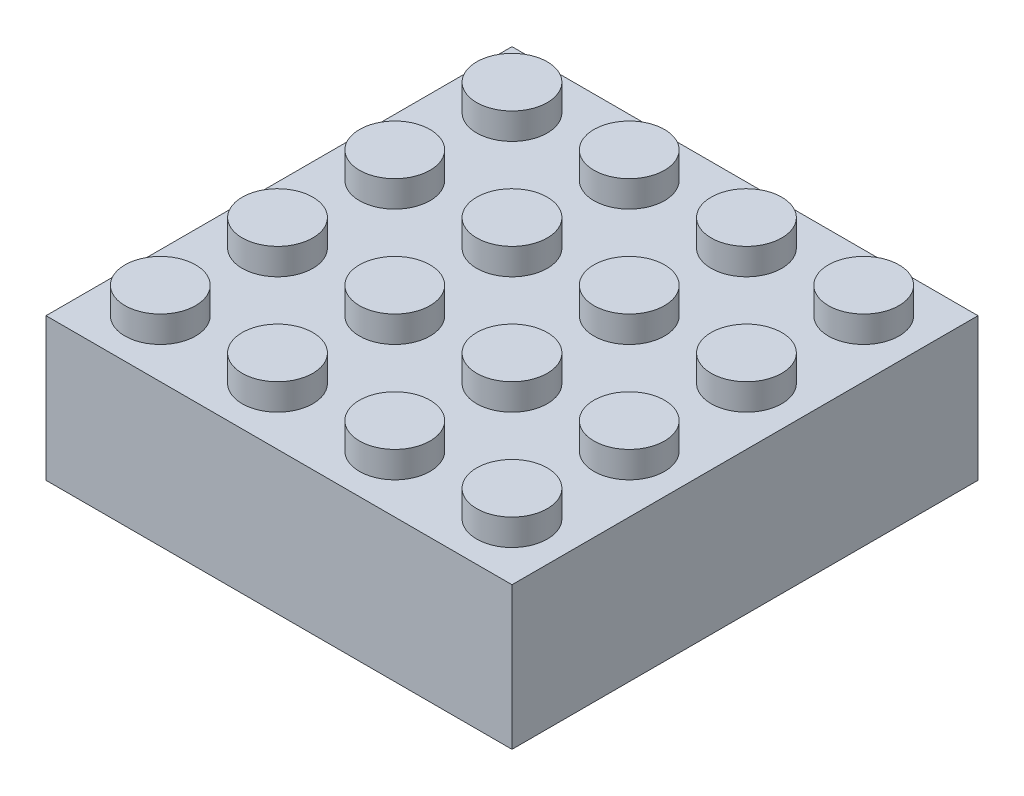
ISO-10303-21;
HEADER;
FILE_DESCRIPTION(('STEP AP214'),'2;1');
FILE_NAME('part.step','',(''),(''),'','','');
FILE_SCHEMA(('AUTOMOTIVE_DESIGN { 1 0 10303 214 1 1 1 1 }'));
ENDSEC;
DATA;
#1=APPLICATION_CONTEXT('core data for automotive mechanical design processes');
#2=APPLICATION_PROTOCOL_DEFINITION('international standard','automotive_design',2000,#1);
#3=PRODUCT_CONTEXT('',#1,'mechanical');
#4=PRODUCT('Part','Part','',(#3));
#5=PRODUCT_RELATED_PRODUCT_CATEGORY('part','',(#4));
#6=PRODUCT_DEFINITION_FORMATION('','',#4);
#7=PRODUCT_DEFINITION_CONTEXT('part definition',#1,'design');
#8=PRODUCT_DEFINITION('design','',#6,#7);
#9=PRODUCT_DEFINITION_SHAPE('','',#8);
#10=(LENGTH_UNIT() NAMED_UNIT(*) SI_UNIT(.MILLI.,.METRE.));
#11=(NAMED_UNIT(*) PLANE_ANGLE_UNIT() SI_UNIT($,.RADIAN.));
#12=(NAMED_UNIT(*) SI_UNIT($,.STERADIAN.) SOLID_ANGLE_UNIT());
#13=UNCERTAINTY_MEASURE_WITH_UNIT(LENGTH_MEASURE(1.E-05),#10,'distance_accuracy_value','');
#14=(GEOMETRIC_REPRESENTATION_CONTEXT(3) GLOBAL_UNCERTAINTY_ASSIGNED_CONTEXT((#13)) GLOBAL_UNIT_ASSIGNED_CONTEXT((#10,
#11,#12)) REPRESENTATION_CONTEXT('',''));
#15=CARTESIAN_POINT('',(0.,0.,0.));
#16=DIRECTION('',(0.,0.,1.));
#17=DIRECTION('',(1.,0.,0.));
#18=AXIS2_PLACEMENT_3D('',#15,#16,#17);
#19=CARTESIAN_POINT('',(3.90000000000025,1.8,-3.9));
#20=DIRECTION('',(0.,-1.,0.));
#21=DIRECTION('',(0.,0.,-1.));
#22=AXIS2_PLACEMENT_3D('',#19,#20,#21);
#23=CYLINDRICAL_SURFACE('',#22,2.41);
#24=CARTESIAN_POINT('',(3.90000000000025,1.8,-3.9));
#25=DIRECTION('',(0.,1.,0.));
#26=DIRECTION('',(0.,0.,1.));
#27=AXIS2_PLACEMENT_3D('',#24,#25,#26);
#28=CIRCLE('',#27,2.41);
#29=CARTESIAN_POINT('',(3.90000000000025,1.8,-1.49));
#30=VERTEX_POINT('',#29);
#31=EDGE_CURVE('E11',#30,#30,#28,.T.);
#32=ORIENTED_EDGE('',*,*,#31,.F.);
#33=EDGE_LOOP('',(#32));
#34=FACE_BOUND('',#33,.T.);
#35=CARTESIAN_POINT('',(3.90000000000025,0.,-3.9));
#36=DIRECTION('',(0.,1.,0.));
#37=DIRECTION('',(0.,0.,1.));
#38=AXIS2_PLACEMENT_3D('',#35,#36,#37);
#39=CIRCLE('',#38,2.41);
#40=CARTESIAN_POINT('',(3.90000000000025,0.,-1.49));
#41=VERTEX_POINT('',#40);
#42=EDGE_CURVE('E43',#41,#41,#39,.T.);
#43=ORIENTED_EDGE('',*,*,#42,.T.);
#44=EDGE_LOOP('',(#43));
#45=FACE_BOUND('',#44,.T.);
#46=ADVANCED_FACE('F40',(#34,#45),#23,.T.);
#47=CARTESIAN_POINT('',(3.90000000000025,1.8,-3.9));
#48=DIRECTION('',(0.,1.,0.));
#49=DIRECTION('',(0.,0.,1.));
#50=AXIS2_PLACEMENT_3D('',#47,#48,#49);
#51=PLANE('',#50);
#52=ORIENTED_EDGE('',*,*,#31,.T.);
#53=EDGE_LOOP('',(#52));
#54=FACE_BOUND('',#53,.T.);
#55=ADVANCED_FACE('F55',(#54),#51,.T.);
#56=CARTESIAN_POINT('',(3.90000000000025,0.,-3.9));
#57=DIRECTION('',(0.,1.,0.));
#58=DIRECTION('',(0.,0.,1.));
#59=AXIS2_PLACEMENT_3D('',#56,#57,#58);
#60=PLANE('',#59);
#61=ORIENTED_EDGE('',*,*,#42,.F.);
#62=EDGE_LOOP('',(#61));
#63=FACE_BOUND('',#62,.T.);
#64=ADVANCED_FACE('F53',(#63),#60,.F.);
#65=CLOSED_SHELL('',(#46,#55,#64));
#66=MANIFOLD_SOLID_BREP('B2',#65);
#67=CARTESIAN_POINT('',(3.90000000000017,1.8,-11.9));
#68=DIRECTION('',(0.,-1.,0.));
#69=DIRECTION('',(0.,0.,-1.));
#70=AXIS2_PLACEMENT_3D('',#67,#68,#69);
#71=CYLINDRICAL_SURFACE('',#70,2.41);
#72=CARTESIAN_POINT('',(3.90000000000017,1.8,-11.9));
#73=DIRECTION('',(0.,1.,0.));
#74=DIRECTION('',(0.,0.,1.));
#75=AXIS2_PLACEMENT_3D('',#72,#73,#74);
#76=CIRCLE('',#75,2.41);
#77=CARTESIAN_POINT('',(3.90000000000017,1.8,-9.49));
#78=VERTEX_POINT('',#77);
#79=EDGE_CURVE('E39',#78,#78,#76,.T.);
#80=ORIENTED_EDGE('',*,*,#79,.F.);
#81=EDGE_LOOP('',(#80));
#82=FACE_BOUND('',#81,.T.);
#83=CARTESIAN_POINT('',(3.90000000000017,0.,-11.9));
#84=DIRECTION('',(0.,1.,0.));
#85=DIRECTION('',(0.,0.,1.));
#86=AXIS2_PLACEMENT_3D('',#83,#84,#85);
#87=CIRCLE('',#86,2.41);
#88=CARTESIAN_POINT('',(3.90000000000017,0.,-9.49));
#89=VERTEX_POINT('',#88);
#90=EDGE_CURVE('E92',#89,#89,#87,.T.);
#91=ORIENTED_EDGE('',*,*,#90,.T.);
#92=EDGE_LOOP('',(#91));
#93=FACE_BOUND('',#92,.T.);
#94=ADVANCED_FACE('F89',(#82,#93),#71,.T.);
#95=CARTESIAN_POINT('',(3.90000000000017,1.8,-11.9));
#96=DIRECTION('',(0.,1.,0.));
#97=DIRECTION('',(0.,0.,1.));
#98=AXIS2_PLACEMENT_3D('',#95,#96,#97);
#99=PLANE('',#98);
#100=ORIENTED_EDGE('',*,*,#79,.T.);
#101=EDGE_LOOP('',(#100));
#102=FACE_BOUND('',#101,.T.);
#103=ADVANCED_FACE('F104',(#102),#99,.T.);
#104=CARTESIAN_POINT('',(3.90000000000017,0.,-11.9));
#105=DIRECTION('',(0.,1.,0.));
#106=DIRECTION('',(0.,0.,1.));
#107=AXIS2_PLACEMENT_3D('',#104,#105,#106);
#108=PLANE('',#107);
#109=ORIENTED_EDGE('',*,*,#90,.F.);
#110=EDGE_LOOP('',(#109));
#111=FACE_BOUND('',#110,.T.);
#112=ADVANCED_FACE('F102',(#111),#108,.F.);
#113=CLOSED_SHELL('',(#94,#103,#112));
#114=MANIFOLD_SOLID_BREP('B6',#113);
#115=CARTESIAN_POINT('',(3.90000000000008,1.8,-19.9));
#116=DIRECTION('',(0.,-1.,0.));
#117=DIRECTION('',(0.,0.,-1.));
#118=AXIS2_PLACEMENT_3D('',#115,#116,#117);
#119=CYLINDRICAL_SURFACE('',#118,2.41);
#120=CARTESIAN_POINT('',(3.90000000000008,1.8,-19.9));
#121=DIRECTION('',(0.,1.,0.));
#122=DIRECTION('',(0.,0.,1.));
#123=AXIS2_PLACEMENT_3D('',#120,#121,#122);
#124=CIRCLE('',#123,2.41);
#125=CARTESIAN_POINT('',(3.90000000000008,1.8,-17.49));
#126=VERTEX_POINT('',#125);
#127=EDGE_CURVE('E88',#126,#126,#124,.T.);
#128=ORIENTED_EDGE('',*,*,#127,.F.);
#129=EDGE_LOOP('',(#128));
#130=FACE_BOUND('',#129,.T.);
#131=CARTESIAN_POINT('',(3.90000000000008,0.,-19.9));
#132=DIRECTION('',(0.,1.,0.));
#133=DIRECTION('',(0.,0.,1.));
#134=AXIS2_PLACEMENT_3D('',#131,#132,#133);
#135=CIRCLE('',#134,2.41);
#136=CARTESIAN_POINT('',(3.90000000000008,0.,-17.49));
#137=VERTEX_POINT('',#136);
#138=EDGE_CURVE('E141',#137,#137,#135,.T.);
#139=ORIENTED_EDGE('',*,*,#138,.T.);
#140=EDGE_LOOP('',(#139));
#141=FACE_BOUND('',#140,.T.);
#142=ADVANCED_FACE('F138',(#130,#141),#119,.T.);
#143=CARTESIAN_POINT('',(3.90000000000008,1.8,-19.9));
#144=DIRECTION('',(0.,1.,0.));
#145=DIRECTION('',(0.,0.,1.));
#146=AXIS2_PLACEMENT_3D('',#143,#144,#145);
#147=PLANE('',#146);
#148=ORIENTED_EDGE('',*,*,#127,.T.);
#149=EDGE_LOOP('',(#148));
#150=FACE_BOUND('',#149,.T.);
#151=ADVANCED_FACE('F153',(#150),#147,.T.);
#152=CARTESIAN_POINT('',(3.90000000000008,0.,-19.9));
#153=DIRECTION('',(0.,1.,0.));
#154=DIRECTION('',(0.,0.,1.));
#155=AXIS2_PLACEMENT_3D('',#152,#153,#154);
#156=PLANE('',#155);
#157=ORIENTED_EDGE('',*,*,#138,.F.);
#158=EDGE_LOOP('',(#157));
#159=FACE_BOUND('',#158,.T.);
#160=ADVANCED_FACE('F151',(#159),#156,.F.);
#161=CLOSED_SHELL('',(#142,#151,#160));
#162=MANIFOLD_SOLID_BREP('B34',#161);
#163=CARTESIAN_POINT('',(27.9000000000003,1.8,-3.9));
#164=DIRECTION('',(0.,-1.,0.));
#165=DIRECTION('',(0.,0.,-1.));
#166=AXIS2_PLACEMENT_3D('',#163,#164,#165);
#167=CYLINDRICAL_SURFACE('',#166,2.41);
#168=CARTESIAN_POINT('',(27.9000000000003,1.8,-3.9));
#169=DIRECTION('',(0.,1.,0.));
#170=DIRECTION('',(0.,0.,1.));
#171=AXIS2_PLACEMENT_3D('',#168,#169,#170);
#172=CIRCLE('',#171,2.41);
#173=CARTESIAN_POINT('',(27.9000000000003,1.8,-1.49));
#174=VERTEX_POINT('',#173);
#175=EDGE_CURVE('E137',#174,#174,#172,.T.);
#176=ORIENTED_EDGE('',*,*,#175,.F.);
#177=EDGE_LOOP('',(#176));
#178=FACE_BOUND('',#177,.T.);
#179=CARTESIAN_POINT('',(27.9000000000003,0.,-3.9));
#180=DIRECTION('',(0.,1.,0.));
#181=DIRECTION('',(0.,0.,1.));
#182=AXIS2_PLACEMENT_3D('',#179,#180,#181);
#183=CIRCLE('',#182,2.41);
#184=CARTESIAN_POINT('',(27.9000000000003,0.,-1.49));
#185=VERTEX_POINT('',#184);
#186=EDGE_CURVE('E190',#185,#185,#183,.T.);
#187=ORIENTED_EDGE('',*,*,#186,.T.);
#188=EDGE_LOOP('',(#187));
#189=FACE_BOUND('',#188,.T.);
#190=ADVANCED_FACE('F187',(#178,#189),#167,.T.);
#191=CARTESIAN_POINT('',(27.9000000000003,1.8,-3.9));
#192=DIRECTION('',(0.,1.,0.));
#193=DIRECTION('',(0.,0.,1.));
#194=AXIS2_PLACEMENT_3D('',#191,#192,#193);
#195=PLANE('',#194);
#196=ORIENTED_EDGE('',*,*,#175,.T.);
#197=EDGE_LOOP('',(#196));
#198=FACE_BOUND('',#197,.T.);
#199=ADVANCED_FACE('F202',(#198),#195,.T.);
#200=CARTESIAN_POINT('',(27.9000000000003,0.,-3.9));
#201=DIRECTION('',(0.,1.,0.));
#202=DIRECTION('',(0.,0.,1.));
#203=AXIS2_PLACEMENT_3D('',#200,#201,#202);
#204=PLANE('',#203);
#205=ORIENTED_EDGE('',*,*,#186,.F.);
#206=EDGE_LOOP('',(#205));
#207=FACE_BOUND('',#206,.T.);
#208=ADVANCED_FACE('F200',(#207),#204,.F.);
#209=CLOSED_SHELL('',(#190,#199,#208));
#210=MANIFOLD_SOLID_BREP('B83',#209);
#211=CARTESIAN_POINT('',(19.9000000000003,1.8,-3.9));
#212=DIRECTION('',(0.,-1.,0.));
#213=DIRECTION('',(0.,0.,-1.));
#214=AXIS2_PLACEMENT_3D('',#211,#212,#213);
#215=CYLINDRICAL_SURFACE('',#214,2.41);
#216=CARTESIAN_POINT('',(19.9000000000003,1.8,-3.9));
#217=DIRECTION('',(0.,1.,0.));
#218=DIRECTION('',(0.,0.,1.));
#219=AXIS2_PLACEMENT_3D('',#216,#217,#218);
#220=CIRCLE('',#219,2.41);
#221=CARTESIAN_POINT('',(19.9000000000003,1.8,-1.49));
#222=VERTEX_POINT('',#221);
#223=EDGE_CURVE('E186',#222,#222,#220,.T.);
#224=ORIENTED_EDGE('',*,*,#223,.F.);
#225=EDGE_LOOP('',(#224));
#226=FACE_BOUND('',#225,.T.);
#227=CARTESIAN_POINT('',(19.9000000000003,0.,-3.9));
#228=DIRECTION('',(0.,1.,0.));
#229=DIRECTION('',(0.,0.,1.));
#230=AXIS2_PLACEMENT_3D('',#227,#228,#229);
#231=CIRCLE('',#230,2.41);
#232=CARTESIAN_POINT('',(19.9000000000003,0.,-1.49));
#233=VERTEX_POINT('',#232);
#234=EDGE_CURVE('E239',#233,#233,#231,.T.);
#235=ORIENTED_EDGE('',*,*,#234,.T.);
#236=EDGE_LOOP('',(#235));
#237=FACE_BOUND('',#236,.T.);
#238=ADVANCED_FACE('F236',(#226,#237),#215,.T.);
#239=CARTESIAN_POINT('',(19.9000000000003,1.8,-3.9));
#240=DIRECTION('',(0.,1.,0.));
#241=DIRECTION('',(0.,0.,1.));
#242=AXIS2_PLACEMENT_3D('',#239,#240,#241);
#243=PLANE('',#242);
#244=ORIENTED_EDGE('',*,*,#223,.T.);
#245=EDGE_LOOP('',(#244));
#246=FACE_BOUND('',#245,.T.);
#247=ADVANCED_FACE('F251',(#246),#243,.T.);
#248=CARTESIAN_POINT('',(19.9000000000003,0.,-3.9));
#249=DIRECTION('',(0.,1.,0.));
#250=DIRECTION('',(0.,0.,1.));
#251=AXIS2_PLACEMENT_3D('',#248,#249,#250);
#252=PLANE('',#251);
#253=ORIENTED_EDGE('',*,*,#234,.F.);
#254=EDGE_LOOP('',(#253));
#255=FACE_BOUND('',#254,.T.);
#256=ADVANCED_FACE('F249',(#255),#252,.F.);
#257=CLOSED_SHELL('',(#238,#247,#256));
#258=MANIFOLD_SOLID_BREP('B132',#257);
#259=CARTESIAN_POINT('',(11.9000000000003,1.8,-3.9));
#260=DIRECTION('',(0.,-1.,0.));
#261=DIRECTION('',(0.,0.,-1.));
#262=AXIS2_PLACEMENT_3D('',#259,#260,#261);
#263=CYLINDRICAL_SURFACE('',#262,2.41);
#264=CARTESIAN_POINT('',(11.9000000000003,1.8,-3.9));
#265=DIRECTION('',(0.,1.,0.));
#266=DIRECTION('',(0.,0.,1.));
#267=AXIS2_PLACEMENT_3D('',#264,#265,#266);
#268=CIRCLE('',#267,2.41);
#269=CARTESIAN_POINT('',(11.9000000000003,1.8,-1.49));
#270=VERTEX_POINT('',#269);
#271=EDGE_CURVE('E235',#270,#270,#268,.T.);
#272=ORIENTED_EDGE('',*,*,#271,.F.);
#273=EDGE_LOOP('',(#272));
#274=FACE_BOUND('',#273,.T.);
#275=CARTESIAN_POINT('',(11.9000000000003,0.,-3.9));
#276=DIRECTION('',(0.,1.,0.));
#277=DIRECTION('',(0.,0.,1.));
#278=AXIS2_PLACEMENT_3D('',#275,#276,#277);
#279=CIRCLE('',#278,2.41);
#280=CARTESIAN_POINT('',(11.9000000000003,0.,-1.49));
#281=VERTEX_POINT('',#280);
#282=EDGE_CURVE('E288',#281,#281,#279,.T.);
#283=ORIENTED_EDGE('',*,*,#282,.T.);
#284=EDGE_LOOP('',(#283));
#285=FACE_BOUND('',#284,.T.);
#286=ADVANCED_FACE('F285',(#274,#285),#263,.T.);
#287=CARTESIAN_POINT('',(11.9000000000003,1.8,-3.9));
#288=DIRECTION('',(0.,1.,0.));
#289=DIRECTION('',(0.,0.,1.));
#290=AXIS2_PLACEMENT_3D('',#287,#288,#289);
#291=PLANE('',#290);
#292=ORIENTED_EDGE('',*,*,#271,.T.);
#293=EDGE_LOOP('',(#292));
#294=FACE_BOUND('',#293,.T.);
#295=ADVANCED_FACE('F300',(#294),#291,.T.);
#296=CARTESIAN_POINT('',(11.9000000000003,0.,-3.9));
#297=DIRECTION('',(0.,1.,0.));
#298=DIRECTION('',(0.,0.,1.));
#299=AXIS2_PLACEMENT_3D('',#296,#297,#298);
#300=PLANE('',#299);
#301=ORIENTED_EDGE('',*,*,#282,.F.);
#302=EDGE_LOOP('',(#301));
#303=FACE_BOUND('',#302,.T.);
#304=ADVANCED_FACE('F298',(#303),#300,.F.);
#305=CLOSED_SHELL('',(#286,#295,#304));
#306=MANIFOLD_SOLID_BREP('B181',#305);
#307=CARTESIAN_POINT('',(27.9000000000002,1.8,-11.9));
#308=DIRECTION('',(0.,-1.,0.));
#309=DIRECTION('',(0.,0.,-1.));
#310=AXIS2_PLACEMENT_3D('',#307,#308,#309);
#311=CYLINDRICAL_SURFACE('',#310,2.41);
#312=CARTESIAN_POINT('',(27.9000000000002,1.8,-11.9));
#313=DIRECTION('',(0.,1.,0.));
#314=DIRECTION('',(0.,0.,1.));
#315=AXIS2_PLACEMENT_3D('',#312,#313,#314);
#316=CIRCLE('',#315,2.41);
#317=CARTESIAN_POINT('',(27.9000000000002,1.8,-9.49));
#318=VERTEX_POINT('',#317);
#319=EDGE_CURVE('E284',#318,#318,#316,.T.);
#320=ORIENTED_EDGE('',*,*,#319,.F.);
#321=EDGE_LOOP('',(#320));
#322=FACE_BOUND('',#321,.T.);
#323=CARTESIAN_POINT('',(27.9000000000002,0.,-11.9));
#324=DIRECTION('',(0.,1.,0.));
#325=DIRECTION('',(0.,0.,1.));
#326=AXIS2_PLACEMENT_3D('',#323,#324,#325);
#327=CIRCLE('',#326,2.41);
#328=CARTESIAN_POINT('',(27.9000000000002,0.,-9.49));
#329=VERTEX_POINT('',#328);
#330=EDGE_CURVE('E337',#329,#329,#327,.T.);
#331=ORIENTED_EDGE('',*,*,#330,.T.);
#332=EDGE_LOOP('',(#331));
#333=FACE_BOUND('',#332,.T.);
#334=ADVANCED_FACE('F334',(#322,#333),#311,.T.);
#335=CARTESIAN_POINT('',(27.9000000000002,1.8,-11.9));
#336=DIRECTION('',(0.,1.,0.));
#337=DIRECTION('',(0.,0.,1.));
#338=AXIS2_PLACEMENT_3D('',#335,#336,#337);
#339=PLANE('',#338);
#340=ORIENTED_EDGE('',*,*,#319,.T.);
#341=EDGE_LOOP('',(#340));
#342=FACE_BOUND('',#341,.T.);
#343=ADVANCED_FACE('F349',(#342),#339,.T.);
#344=CARTESIAN_POINT('',(27.9000000000002,0.,-11.9));
#345=DIRECTION('',(0.,1.,0.));
#346=DIRECTION('',(0.,0.,1.));
#347=AXIS2_PLACEMENT_3D('',#344,#345,#346);
#348=PLANE('',#347);
#349=ORIENTED_EDGE('',*,*,#330,.F.);
#350=EDGE_LOOP('',(#349));
#351=FACE_BOUND('',#350,.T.);
#352=ADVANCED_FACE('F347',(#351),#348,.F.);
#353=CLOSED_SHELL('',(#334,#343,#352));
#354=MANIFOLD_SOLID_BREP('B230',#353);
#355=CARTESIAN_POINT('',(19.9000000000002,1.8,-11.9));
#356=DIRECTION('',(0.,-1.,0.));
#357=DIRECTION('',(0.,0.,-1.));
#358=AXIS2_PLACEMENT_3D('',#355,#356,#357);
#359=CYLINDRICAL_SURFACE('',#358,2.41);
#360=CARTESIAN_POINT('',(19.9000000000002,1.8,-11.9));
#361=DIRECTION('',(0.,1.,0.));
#362=DIRECTION('',(0.,0.,1.));
#363=AXIS2_PLACEMENT_3D('',#360,#361,#362);
#364=CIRCLE('',#363,2.41);
#365=CARTESIAN_POINT('',(19.9000000000002,1.8,-9.49));
#366=VERTEX_POINT('',#365);
#367=EDGE_CURVE('E333',#366,#366,#364,.T.);
#368=ORIENTED_EDGE('',*,*,#367,.F.);
#369=EDGE_LOOP('',(#368));
#370=FACE_BOUND('',#369,.T.);
#371=CARTESIAN_POINT('',(19.9000000000002,0.,-11.9));
#372=DIRECTION('',(0.,1.,0.));
#373=DIRECTION('',(0.,0.,1.));
#374=AXIS2_PLACEMENT_3D('',#371,#372,#373);
#375=CIRCLE('',#374,2.41);
#376=CARTESIAN_POINT('',(19.9000000000002,0.,-9.49));
#377=VERTEX_POINT('',#376);
#378=EDGE_CURVE('E386',#377,#377,#375,.T.);
#379=ORIENTED_EDGE('',*,*,#378,.T.);
#380=EDGE_LOOP('',(#379));
#381=FACE_BOUND('',#380,.T.);
#382=ADVANCED_FACE('F383',(#370,#381),#359,.T.);
#383=CARTESIAN_POINT('',(19.9000000000002,1.8,-11.9));
#384=DIRECTION('',(0.,1.,0.));
#385=DIRECTION('',(0.,0.,1.));
#386=AXIS2_PLACEMENT_3D('',#383,#384,#385);
#387=PLANE('',#386);
#388=ORIENTED_EDGE('',*,*,#367,.T.);
#389=EDGE_LOOP('',(#388));
#390=FACE_BOUND('',#389,.T.);
#391=ADVANCED_FACE('F398',(#390),#387,.T.);
#392=CARTESIAN_POINT('',(19.9000000000002,0.,-11.9));
#393=DIRECTION('',(0.,1.,0.));
#394=DIRECTION('',(0.,0.,1.));
#395=AXIS2_PLACEMENT_3D('',#392,#393,#394);
#396=PLANE('',#395);
#397=ORIENTED_EDGE('',*,*,#378,.F.);
#398=EDGE_LOOP('',(#397));
#399=FACE_BOUND('',#398,.T.);
#400=ADVANCED_FACE('F396',(#399),#396,.F.);
#401=CLOSED_SHELL('',(#382,#391,#400));
#402=MANIFOLD_SOLID_BREP('B279',#401);
#403=CARTESIAN_POINT('',(11.9000000000002,1.8,-11.9));
#404=DIRECTION('',(0.,-1.,0.));
#405=DIRECTION('',(0.,0.,-1.));
#406=AXIS2_PLACEMENT_3D('',#403,#404,#405);
#407=CYLINDRICAL_SURFACE('',#406,2.41);
#408=CARTESIAN_POINT('',(11.9000000000002,1.8,-11.9));
#409=DIRECTION('',(0.,1.,0.));
#410=DIRECTION('',(0.,0.,1.));
#411=AXIS2_PLACEMENT_3D('',#408,#409,#410);
#412=CIRCLE('',#411,2.41);
#413=CARTESIAN_POINT('',(11.9000000000002,1.8,-9.49));
#414=VERTEX_POINT('',#413);
#415=EDGE_CURVE('E382',#414,#414,#412,.T.);
#416=ORIENTED_EDGE('',*,*,#415,.F.);
#417=EDGE_LOOP('',(#416));
#418=FACE_BOUND('',#417,.T.);
#419=CARTESIAN_POINT('',(11.9000000000002,0.,-11.9));
#420=DIRECTION('',(0.,1.,0.));
#421=DIRECTION('',(0.,0.,1.));
#422=AXIS2_PLACEMENT_3D('',#419,#420,#421);
#423=CIRCLE('',#422,2.41);
#424=CARTESIAN_POINT('',(11.9000000000002,0.,-9.49));
#425=VERTEX_POINT('',#424);
#426=EDGE_CURVE('E435',#425,#425,#423,.T.);
#427=ORIENTED_EDGE('',*,*,#426,.T.);
#428=EDGE_LOOP('',(#427));
#429=FACE_BOUND('',#428,.T.);
#430=ADVANCED_FACE('F432',(#418,#429),#407,.T.);
#431=CARTESIAN_POINT('',(11.9000000000002,1.8,-11.9));
#432=DIRECTION('',(0.,1.,0.));
#433=DIRECTION('',(0.,0.,1.));
#434=AXIS2_PLACEMENT_3D('',#431,#432,#433);
#435=PLANE('',#434);
#436=ORIENTED_EDGE('',*,*,#415,.T.);
#437=EDGE_LOOP('',(#436));
#438=FACE_BOUND('',#437,.T.);
#439=ADVANCED_FACE('F447',(#438),#435,.T.);
#440=CARTESIAN_POINT('',(11.9000000000002,0.,-11.9));
#441=DIRECTION('',(0.,1.,0.));
#442=DIRECTION('',(0.,0.,1.));
#443=AXIS2_PLACEMENT_3D('',#440,#441,#442);
#444=PLANE('',#443);
#445=ORIENTED_EDGE('',*,*,#426,.F.);
#446=EDGE_LOOP('',(#445));
#447=FACE_BOUND('',#446,.T.);
#448=ADVANCED_FACE('F445',(#447),#444,.F.);
#449=CLOSED_SHELL('',(#430,#439,#448));
#450=MANIFOLD_SOLID_BREP('B328',#449);
#451=CARTESIAN_POINT('',(27.9000000000001,1.8,-19.9));
#452=DIRECTION('',(0.,-1.,0.));
#453=DIRECTION('',(0.,0.,-1.));
#454=AXIS2_PLACEMENT_3D('',#451,#452,#453);
#455=CYLINDRICAL_SURFACE('',#454,2.41);
#456=CARTESIAN_POINT('',(27.9000000000001,1.8,-19.9));
#457=DIRECTION('',(0.,1.,0.));
#458=DIRECTION('',(0.,0.,1.));
#459=AXIS2_PLACEMENT_3D('',#456,#457,#458);
#460=CIRCLE('',#459,2.41);
#461=CARTESIAN_POINT('',(27.9000000000001,1.8,-17.49));
#462=VERTEX_POINT('',#461);
#463=EDGE_CURVE('E431',#462,#462,#460,.T.);
#464=ORIENTED_EDGE('',*,*,#463,.F.);
#465=EDGE_LOOP('',(#464));
#466=FACE_BOUND('',#465,.T.);
#467=CARTESIAN_POINT('',(27.9000000000001,0.,-19.9));
#468=DIRECTION('',(0.,1.,0.));
#469=DIRECTION('',(0.,0.,1.));
#470=AXIS2_PLACEMENT_3D('',#467,#468,#469);
#471=CIRCLE('',#470,2.41);
#472=CARTESIAN_POINT('',(27.9000000000001,0.,-17.49));
#473=VERTEX_POINT('',#472);
#474=EDGE_CURVE('E484',#473,#473,#471,.T.);
#475=ORIENTED_EDGE('',*,*,#474,.T.);
#476=EDGE_LOOP('',(#475));
#477=FACE_BOUND('',#476,.T.);
#478=ADVANCED_FACE('F481',(#466,#477),#455,.T.);
#479=CARTESIAN_POINT('',(27.9000000000001,1.8,-19.9));
#480=DIRECTION('',(0.,1.,0.));
#481=DIRECTION('',(0.,0.,1.));
#482=AXIS2_PLACEMENT_3D('',#479,#480,#481);
#483=PLANE('',#482);
#484=ORIENTED_EDGE('',*,*,#463,.T.);
#485=EDGE_LOOP('',(#484));
#486=FACE_BOUND('',#485,.T.);
#487=ADVANCED_FACE('F496',(#486),#483,.T.);
#488=CARTESIAN_POINT('',(27.9000000000001,0.,-19.9));
#489=DIRECTION('',(0.,1.,0.));
#490=DIRECTION('',(0.,0.,1.));
#491=AXIS2_PLACEMENT_3D('',#488,#489,#490);
#492=PLANE('',#491);
#493=ORIENTED_EDGE('',*,*,#474,.F.);
#494=EDGE_LOOP('',(#493));
#495=FACE_BOUND('',#494,.T.);
#496=ADVANCED_FACE('F494',(#495),#492,.F.);
#497=CLOSED_SHELL('',(#478,#487,#496));
#498=MANIFOLD_SOLID_BREP('B377',#497);
#499=CARTESIAN_POINT('',(19.9000000000001,1.8,-19.9));
#500=DIRECTION('',(0.,-1.,0.));
#501=DIRECTION('',(0.,0.,-1.));
#502=AXIS2_PLACEMENT_3D('',#499,#500,#501);
#503=CYLINDRICAL_SURFACE('',#502,2.41);
#504=CARTESIAN_POINT('',(19.9000000000001,1.8,-19.9));
#505=DIRECTION('',(0.,1.,0.));
#506=DIRECTION('',(0.,0.,1.));
#507=AXIS2_PLACEMENT_3D('',#504,#505,#506);
#508=CIRCLE('',#507,2.41);
#509=CARTESIAN_POINT('',(19.9000000000001,1.8,-17.49));
#510=VERTEX_POINT('',#509);
#511=EDGE_CURVE('E480',#510,#510,#508,.T.);
#512=ORIENTED_EDGE('',*,*,#511,.F.);
#513=EDGE_LOOP('',(#512));
#514=FACE_BOUND('',#513,.T.);
#515=CARTESIAN_POINT('',(19.9000000000001,0.,-19.9));
#516=DIRECTION('',(0.,1.,0.));
#517=DIRECTION('',(0.,0.,1.));
#518=AXIS2_PLACEMENT_3D('',#515,#516,#517);
#519=CIRCLE('',#518,2.41);
#520=CARTESIAN_POINT('',(19.9000000000001,0.,-17.49));
#521=VERTEX_POINT('',#520);
#522=EDGE_CURVE('E533',#521,#521,#519,.T.);
#523=ORIENTED_EDGE('',*,*,#522,.T.);
#524=EDGE_LOOP('',(#523));
#525=FACE_BOUND('',#524,.T.);
#526=ADVANCED_FACE('F530',(#514,#525),#503,.T.);
#527=CARTESIAN_POINT('',(19.9000000000001,1.8,-19.9));
#528=DIRECTION('',(0.,1.,0.));
#529=DIRECTION('',(0.,0.,1.));
#530=AXIS2_PLACEMENT_3D('',#527,#528,#529);
#531=PLANE('',#530);
#532=ORIENTED_EDGE('',*,*,#511,.T.);
#533=EDGE_LOOP('',(#532));
#534=FACE_BOUND('',#533,.T.);
#535=ADVANCED_FACE('F545',(#534),#531,.T.);
#536=CARTESIAN_POINT('',(19.9000000000001,0.,-19.9));
#537=DIRECTION('',(0.,1.,0.));
#538=DIRECTION('',(0.,0.,1.));
#539=AXIS2_PLACEMENT_3D('',#536,#537,#538);
#540=PLANE('',#539);
#541=ORIENTED_EDGE('',*,*,#522,.F.);
#542=EDGE_LOOP('',(#541));
#543=FACE_BOUND('',#542,.T.);
#544=ADVANCED_FACE('F543',(#543),#540,.F.);
#545=CLOSED_SHELL('',(#526,#535,#544));
#546=MANIFOLD_SOLID_BREP('B426',#545);
#547=CARTESIAN_POINT('',(11.9000000000001,1.8,-19.9));
#548=DIRECTION('',(0.,-1.,0.));
#549=DIRECTION('',(0.,0.,-1.));
#550=AXIS2_PLACEMENT_3D('',#547,#548,#549);
#551=CYLINDRICAL_SURFACE('',#550,2.41);
#552=CARTESIAN_POINT('',(11.9000000000001,1.8,-19.9));
#553=DIRECTION('',(0.,1.,0.));
#554=DIRECTION('',(0.,0.,1.));
#555=AXIS2_PLACEMENT_3D('',#552,#553,#554);
#556=CIRCLE('',#555,2.41);
#557=CARTESIAN_POINT('',(11.9000000000001,1.8,-17.49));
#558=VERTEX_POINT('',#557);
#559=EDGE_CURVE('E529',#558,#558,#556,.T.);
#560=ORIENTED_EDGE('',*,*,#559,.F.);
#561=EDGE_LOOP('',(#560));
#562=FACE_BOUND('',#561,.T.);
#563=CARTESIAN_POINT('',(11.9000000000001,0.,-19.9));
#564=DIRECTION('',(0.,1.,0.));
#565=DIRECTION('',(0.,0.,1.));
#566=AXIS2_PLACEMENT_3D('',#563,#564,#565);
#567=CIRCLE('',#566,2.41);
#568=CARTESIAN_POINT('',(11.9000000000001,0.,-17.49));
#569=VERTEX_POINT('',#568);
#570=EDGE_CURVE('E582',#569,#569,#567,.T.);
#571=ORIENTED_EDGE('',*,*,#570,.T.);
#572=EDGE_LOOP('',(#571));
#573=FACE_BOUND('',#572,.T.);
#574=ADVANCED_FACE('F579',(#562,#573),#551,.T.);
#575=CARTESIAN_POINT('',(11.9000000000001,1.8,-19.9));
#576=DIRECTION('',(0.,1.,0.));
#577=DIRECTION('',(0.,0.,1.));
#578=AXIS2_PLACEMENT_3D('',#575,#576,#577);
#579=PLANE('',#578);
#580=ORIENTED_EDGE('',*,*,#559,.T.);
#581=EDGE_LOOP('',(#580));
#582=FACE_BOUND('',#581,.T.);
#583=ADVANCED_FACE('F594',(#582),#579,.T.);
#584=CARTESIAN_POINT('',(11.9000000000001,0.,-19.9));
#585=DIRECTION('',(0.,1.,0.));
#586=DIRECTION('',(0.,0.,1.));
#587=AXIS2_PLACEMENT_3D('',#584,#585,#586);
#588=PLANE('',#587);
#589=ORIENTED_EDGE('',*,*,#570,.F.);
#590=EDGE_LOOP('',(#589));
#591=FACE_BOUND('',#590,.T.);
#592=ADVANCED_FACE('F592',(#591),#588,.F.);
#593=CLOSED_SHELL('',(#574,#583,#592));
#594=MANIFOLD_SOLID_BREP('B475',#593);
#595=CARTESIAN_POINT('',(27.9,1.8,-27.9));
#596=DIRECTION('',(0.,-1.,0.));
#597=DIRECTION('',(0.,0.,-1.));
#598=AXIS2_PLACEMENT_3D('',#595,#596,#597);
#599=CYLINDRICAL_SURFACE('',#598,2.41);
#600=CARTESIAN_POINT('',(27.9,1.8,-27.9));
#601=DIRECTION('',(0.,1.,0.));
#602=DIRECTION('',(0.,0.,1.));
#603=AXIS2_PLACEMENT_3D('',#600,#601,#602);
#604=CIRCLE('',#603,2.41);
#605=CARTESIAN_POINT('',(27.9,1.8,-25.49));
#606=VERTEX_POINT('',#605);
#607=EDGE_CURVE('E578',#606,#606,#604,.T.);
#608=ORIENTED_EDGE('',*,*,#607,.F.);
#609=EDGE_LOOP('',(#608));
#610=FACE_BOUND('',#609,.T.);
#611=CARTESIAN_POINT('',(27.9,0.,-27.9));
#612=DIRECTION('',(0.,1.,0.));
#613=DIRECTION('',(0.,0.,1.));
#614=AXIS2_PLACEMENT_3D('',#611,#612,#613);
#615=CIRCLE('',#614,2.41);
#616=CARTESIAN_POINT('',(27.9,0.,-25.49));
#617=VERTEX_POINT('',#616);
#618=EDGE_CURVE('E631',#617,#617,#615,.T.);
#619=ORIENTED_EDGE('',*,*,#618,.T.);
#620=EDGE_LOOP('',(#619));
#621=FACE_BOUND('',#620,.T.);
#622=ADVANCED_FACE('F628',(#610,#621),#599,.T.);
#623=CARTESIAN_POINT('',(27.9,1.8,-27.9));
#624=DIRECTION('',(0.,1.,0.));
#625=DIRECTION('',(0.,0.,1.));
#626=AXIS2_PLACEMENT_3D('',#623,#624,#625);
#627=PLANE('',#626);
#628=ORIENTED_EDGE('',*,*,#607,.T.);
#629=EDGE_LOOP('',(#628));
#630=FACE_BOUND('',#629,.T.);
#631=ADVANCED_FACE('F643',(#630),#627,.T.);
#632=CARTESIAN_POINT('',(27.9,0.,-27.9));
#633=DIRECTION('',(0.,1.,0.));
#634=DIRECTION('',(0.,0.,1.));
#635=AXIS2_PLACEMENT_3D('',#632,#633,#634);
#636=PLANE('',#635);
#637=ORIENTED_EDGE('',*,*,#618,.F.);
#638=EDGE_LOOP('',(#637));
#639=FACE_BOUND('',#638,.T.);
#640=ADVANCED_FACE('F641',(#639),#636,.F.);
#641=CLOSED_SHELL('',(#622,#631,#640));
#642=MANIFOLD_SOLID_BREP('B524',#641);
#643=CARTESIAN_POINT('',(19.9,1.8,-27.9));
#644=DIRECTION('',(0.,-1.,0.));
#645=DIRECTION('',(0.,0.,-1.));
#646=AXIS2_PLACEMENT_3D('',#643,#644,#645);
#647=CYLINDRICAL_SURFACE('',#646,2.41);
#648=CARTESIAN_POINT('',(19.9,1.8,-27.9));
#649=DIRECTION('',(0.,1.,0.));
#650=DIRECTION('',(0.,0.,1.));
#651=AXIS2_PLACEMENT_3D('',#648,#649,#650);
#652=CIRCLE('',#651,2.41);
#653=CARTESIAN_POINT('',(19.9,1.8,-25.49));
#654=VERTEX_POINT('',#653);
#655=EDGE_CURVE('E627',#654,#654,#652,.T.);
#656=ORIENTED_EDGE('',*,*,#655,.F.);
#657=EDGE_LOOP('',(#656));
#658=FACE_BOUND('',#657,.T.);
#659=CARTESIAN_POINT('',(19.9,0.,-27.9));
#660=DIRECTION('',(0.,1.,0.));
#661=DIRECTION('',(0.,0.,1.));
#662=AXIS2_PLACEMENT_3D('',#659,#660,#661);
#663=CIRCLE('',#662,2.41);
#664=CARTESIAN_POINT('',(19.9,0.,-25.49));
#665=VERTEX_POINT('',#664);
#666=EDGE_CURVE('E680',#665,#665,#663,.T.);
#667=ORIENTED_EDGE('',*,*,#666,.T.);
#668=EDGE_LOOP('',(#667));
#669=FACE_BOUND('',#668,.T.);
#670=ADVANCED_FACE('F677',(#658,#669),#647,.T.);
#671=CARTESIAN_POINT('',(19.9,1.8,-27.9));
#672=DIRECTION('',(0.,1.,0.));
#673=DIRECTION('',(0.,0.,1.));
#674=AXIS2_PLACEMENT_3D('',#671,#672,#673);
#675=PLANE('',#674);
#676=ORIENTED_EDGE('',*,*,#655,.T.);
#677=EDGE_LOOP('',(#676));
#678=FACE_BOUND('',#677,.T.);
#679=ADVANCED_FACE('F692',(#678),#675,.T.);
#680=CARTESIAN_POINT('',(19.9,0.,-27.9));
#681=DIRECTION('',(0.,1.,0.));
#682=DIRECTION('',(0.,0.,1.));
#683=AXIS2_PLACEMENT_3D('',#680,#681,#682);
#684=PLANE('',#683);
#685=ORIENTED_EDGE('',*,*,#666,.F.);
#686=EDGE_LOOP('',(#685));
#687=FACE_BOUND('',#686,.T.);
#688=ADVANCED_FACE('F690',(#687),#684,.F.);
#689=CLOSED_SHELL('',(#670,#679,#688));
#690=MANIFOLD_SOLID_BREP('B573',#689);
#691=CARTESIAN_POINT('',(11.9,1.8,-27.9));
#692=DIRECTION('',(0.,-1.,0.));
#693=DIRECTION('',(0.,0.,-1.));
#694=AXIS2_PLACEMENT_3D('',#691,#692,#693);
#695=CYLINDRICAL_SURFACE('',#694,2.41);
#696=CARTESIAN_POINT('',(11.9,1.8,-27.9));
#697=DIRECTION('',(0.,1.,0.));
#698=DIRECTION('',(0.,0.,1.));
#699=AXIS2_PLACEMENT_3D('',#696,#697,#698);
#700=CIRCLE('',#699,2.41);
#701=CARTESIAN_POINT('',(11.9,1.8,-25.49));
#702=VERTEX_POINT('',#701);
#703=EDGE_CURVE('E676',#702,#702,#700,.T.);
#704=ORIENTED_EDGE('',*,*,#703,.F.);
#705=EDGE_LOOP('',(#704));
#706=FACE_BOUND('',#705,.T.);
#707=CARTESIAN_POINT('',(11.9,0.,-27.9));
#708=DIRECTION('',(0.,1.,0.));
#709=DIRECTION('',(0.,0.,1.));
#710=AXIS2_PLACEMENT_3D('',#707,#708,#709);
#711=CIRCLE('',#710,2.41);
#712=CARTESIAN_POINT('',(11.9,0.,-25.49));
#713=VERTEX_POINT('',#712);
#714=EDGE_CURVE('E730',#713,#713,#711,.T.);
#715=ORIENTED_EDGE('',*,*,#714,.T.);
#716=EDGE_LOOP('',(#715));
#717=FACE_BOUND('',#716,.T.);
#718=ADVANCED_FACE('F727',(#706,#717),#695,.T.);
#719=CARTESIAN_POINT('',(11.9,1.8,-27.9));
#720=DIRECTION('',(0.,1.,0.));
#721=DIRECTION('',(0.,0.,1.));
#722=AXIS2_PLACEMENT_3D('',#719,#720,#721);
#723=PLANE('',#722);
#724=ORIENTED_EDGE('',*,*,#703,.T.);
#725=EDGE_LOOP('',(#724));
#726=FACE_BOUND('',#725,.T.);
#727=ADVANCED_FACE('F742',(#726),#723,.T.);
#728=CARTESIAN_POINT('',(11.9,0.,-27.9));
#729=DIRECTION('',(0.,1.,0.));
#730=DIRECTION('',(0.,0.,1.));
#731=AXIS2_PLACEMENT_3D('',#728,#729,#730);
#732=PLANE('',#731);
#733=ORIENTED_EDGE('',*,*,#714,.F.);
#734=EDGE_LOOP('',(#733));
#735=FACE_BOUND('',#734,.T.);
#736=ADVANCED_FACE('F740',(#735),#732,.F.);
#737=CLOSED_SHELL('',(#718,#727,#736));
#738=MANIFOLD_SOLID_BREP('B622',#737);
#739=CARTESIAN_POINT('',(3.9,1.8,-27.9));
#740=DIRECTION('',(0.,-1.,0.));
#741=DIRECTION('',(0.,0.,-1.));
#742=AXIS2_PLACEMENT_3D('',#739,#740,#741);
#743=CYLINDRICAL_SURFACE('',#742,2.41);
#744=CARTESIAN_POINT('',(3.9,1.8,-27.9));
#745=DIRECTION('',(0.,1.,0.));
#746=DIRECTION('',(0.,0.,1.));
#747=AXIS2_PLACEMENT_3D('',#744,#745,#746);
#748=CIRCLE('',#747,2.41);
#749=CARTESIAN_POINT('',(3.9,1.8,-25.49));
#750=VERTEX_POINT('',#749);
#751=EDGE_CURVE('E725',#750,#750,#748,.T.);
#752=ORIENTED_EDGE('',*,*,#751,.F.);
#753=EDGE_LOOP('',(#752));
#754=FACE_BOUND('',#753,.T.);
#755=CARTESIAN_POINT('',(3.9,0.,-27.9));
#756=DIRECTION('',(0.,1.,0.));
#757=DIRECTION('',(0.,0.,1.));
#758=AXIS2_PLACEMENT_3D('',#755,#756,#757);
#759=CIRCLE('',#758,2.41);
#760=CARTESIAN_POINT('',(3.9,0.,-25.49));
#761=VERTEX_POINT('',#760);
#762=EDGE_CURVE('E771',#761,#761,#759,.T.);
#763=ORIENTED_EDGE('',*,*,#762,.T.);
#764=EDGE_LOOP('',(#763));
#765=FACE_BOUND('',#764,.T.);
#766=ADVANCED_FACE('F768',(#754,#765),#743,.T.);
#767=CARTESIAN_POINT('',(3.9,1.8,-27.9));
#768=DIRECTION('',(0.,1.,0.));
#769=DIRECTION('',(0.,0.,1.));
#770=AXIS2_PLACEMENT_3D('',#767,#768,#769);
#771=PLANE('',#770);
#772=ORIENTED_EDGE('',*,*,#751,.T.);
#773=EDGE_LOOP('',(#772));
#774=FACE_BOUND('',#773,.T.);
#775=ADVANCED_FACE('F957',(#774),#771,.T.);
#776=CARTESIAN_POINT('',(0.,-9.73,0.));
#777=DIRECTION('',(-1.,0.,0.));
#778=DIRECTION('',(0.,0.,1.));
#779=AXIS2_PLACEMENT_3D('',#776,#777,#778);
#780=PLANE('',#779);
#781=DIRECTION('',(0.,0.,1.));
#782=VECTOR('',#781,1.);
#783=CARTESIAN_POINT('',(0.,0.,0.));
#784=LINE('',#783,#782);
#785=CARTESIAN_POINT('',(0.,0.,-31.8));
#786=VERTEX_POINT('',#785);
#787=CARTESIAN_POINT('',(0.,0.,0.));
#788=VERTEX_POINT('',#787);
#789=EDGE_CURVE('E900',#786,#788,#784,.T.);
#790=ORIENTED_EDGE('',*,*,#789,.F.);
#791=DIRECTION('',(0.,1.,0.));
#792=VECTOR('',#791,1.);
#793=CARTESIAN_POINT('',(0.,-9.73,-31.8));
#794=LINE('',#793,#792);
#795=CARTESIAN_POINT('',(0.,-9.73,-31.8));
#796=VERTEX_POINT('',#795);
#797=EDGE_CURVE('E791',#796,#786,#794,.T.);
#798=ORIENTED_EDGE('',*,*,#797,.F.);
#799=DIRECTION('',(0.,0.,1.));
#800=VECTOR('',#799,1.);
#801=CARTESIAN_POINT('',(0.,-9.73,0.));
#802=LINE('',#801,#800);
#803=CARTESIAN_POINT('',(0.,-9.73,0.));
#804=VERTEX_POINT('',#803);
#805=EDGE_CURVE('E908',#796,#804,#802,.T.);
#806=ORIENTED_EDGE('',*,*,#805,.T.);
#807=DIRECTION('',(0.,1.,0.));
#808=VECTOR('',#807,1.);
#809=CARTESIAN_POINT('',(0.,-9.73,0.));
#810=LINE('',#809,#808);
#811=EDGE_CURVE('E817',#804,#788,#810,.T.);
#812=ORIENTED_EDGE('',*,*,#811,.T.);
#813=EDGE_LOOP('',(#790,#798,#806,#812));
#814=FACE_BOUND('',#813,.T.);
#815=ADVANCED_FACE('F933',(#814),#780,.T.);
#816=CARTESIAN_POINT('',(0.,-9.73,-31.8));
#817=DIRECTION('',(0.,0.,-1.));
#818=DIRECTION('',(-1.,0.,0.));
#819=AXIS2_PLACEMENT_3D('',#816,#817,#818);
#820=PLANE('',#819);
#821=DIRECTION('',(-1.,0.,0.));
#822=VECTOR('',#821,1.);
#823=CARTESIAN_POINT('',(0.,0.,-31.8));
#824=LINE('',#823,#822);
#825=CARTESIAN_POINT('',(31.8,0.,-31.8));
#826=VERTEX_POINT('',#825);
#827=EDGE_CURVE('E911',#826,#786,#824,.T.);
#828=ORIENTED_EDGE('',*,*,#827,.F.);
#829=DIRECTION('',(0.,1.,0.));
#830=VECTOR('',#829,1.);
#831=CARTESIAN_POINT('',(31.8,-9.73,-31.8));
#832=LINE('',#831,#830);
#833=CARTESIAN_POINT('',(31.8,-9.73,-31.8));
#834=VERTEX_POINT('',#833);
#835=EDGE_CURVE('E929',#834,#826,#832,.T.);
#836=ORIENTED_EDGE('',*,*,#835,.F.);
#837=DIRECTION('',(-1.,0.,0.));
#838=VECTOR('',#837,1.);
#839=CARTESIAN_POINT('',(0.,-9.73,-31.8));
#840=LINE('',#839,#838);
#841=EDGE_CURVE('E916',#834,#796,#840,.T.);
#842=ORIENTED_EDGE('',*,*,#841,.T.);
#843=ORIENTED_EDGE('',*,*,#797,.T.);
#844=EDGE_LOOP('',(#828,#836,#842,#843));
#845=FACE_BOUND('',#844,.T.);
#846=ADVANCED_FACE('F938',(#845),#820,.T.);
#847=CARTESIAN_POINT('',(31.8,-9.73,0.));
#848=DIRECTION('',(1.,0.,0.));
#849=DIRECTION('',(0.,0.,-1.));
#850=AXIS2_PLACEMENT_3D('',#847,#848,#849);
#851=PLANE('',#850);
#852=DIRECTION('',(0.,0.,-1.));
#853=VECTOR('',#852,1.);
#854=CARTESIAN_POINT('',(31.8,0.,0.));
#855=LINE('',#854,#853);
#856=CARTESIAN_POINT('',(31.8,0.,0.));
#857=VERTEX_POINT('',#856);
#858=EDGE_CURVE('E923',#857,#826,#855,.T.);
#859=ORIENTED_EDGE('',*,*,#858,.F.);
#860=DIRECTION('',(0.,1.,0.));
#861=VECTOR('',#860,1.);
#862=CARTESIAN_POINT('',(31.8,-9.73,0.));
#863=LINE('',#862,#861);
#864=CARTESIAN_POINT('',(31.8,-9.73,0.));
#865=VERTEX_POINT('',#864);
#866=EDGE_CURVE('E931',#865,#857,#863,.T.);
#867=ORIENTED_EDGE('',*,*,#866,.F.);
#868=DIRECTION('',(0.,0.,-1.));
#869=VECTOR('',#868,1.);
#870=CARTESIAN_POINT('',(31.8,-9.73,0.));
#871=LINE('',#870,#869);
#872=EDGE_CURVE('E913',#865,#834,#871,.T.);
#873=ORIENTED_EDGE('',*,*,#872,.T.);
#874=ORIENTED_EDGE('',*,*,#835,.T.);
#875=EDGE_LOOP('',(#859,#867,#873,#874));
#876=FACE_BOUND('',#875,.T.);
#877=ADVANCED_FACE('F942',(#876),#851,.T.);
#878=CARTESIAN_POINT('',(0.,-9.73,0.));
#879=DIRECTION('',(0.,0.,1.));
#880=DIRECTION('',(1.,0.,0.));
#881=AXIS2_PLACEMENT_3D('',#878,#879,#880);
#882=PLANE('',#881);
#883=DIRECTION('',(1.,0.,0.));
#884=VECTOR('',#883,1.);
#885=CARTESIAN_POINT('',(0.,0.,0.));
#886=LINE('',#885,#884);
#887=EDGE_CURVE('E920',#788,#857,#886,.T.);
#888=ORIENTED_EDGE('',*,*,#887,.F.);
#889=ORIENTED_EDGE('',*,*,#811,.F.);
#890=DIRECTION('',(1.,0.,0.));
#891=VECTOR('',#890,1.);
#892=CARTESIAN_POINT('',(0.,-9.73,0.));
#893=LINE('',#892,#891);
#894=EDGE_CURVE('E910',#804,#865,#893,.T.);
#895=ORIENTED_EDGE('',*,*,#894,.T.);
#896=ORIENTED_EDGE('',*,*,#866,.T.);
#897=EDGE_LOOP('',(#888,#889,#895,#896));
#898=FACE_BOUND('',#897,.T.);
#899=ADVANCED_FACE('F934',(#898),#882,.T.);
#900=CARTESIAN_POINT('',(0.,-9.73,0.));
#901=DIRECTION('',(0.,-1.,0.));
#902=DIRECTION('',(0.,0.,-1.));
#903=AXIS2_PLACEMENT_3D('',#900,#901,#902);
#904=PLANE('',#903);
#905=DIRECTION('',(0.5,0.,0.866025403784439));
#906=VECTOR('',#905,1.);
#907=CARTESIAN_POINT('',(20.52,-9.73,-23.9020747309682));
#908=LINE('',#907,#906);
#909=CARTESIAN_POINT('',(20.52,-9.73,-23.9020747309682));
#910=VERTEX_POINT('',#909);
#911=CARTESIAN_POINT('',(25.14,-9.73,-15.9));
#912=VERTEX_POINT('',#911);
#913=EDGE_CURVE('E782',#910,#912,#908,.T.);
#914=ORIENTED_EDGE('',*,*,#913,.F.);
#915=DIRECTION('',(1.,0.,0.));
#916=VECTOR('',#915,1.);
#917=CARTESIAN_POINT('',(11.28,-9.73,-23.9020747309682));
#918=LINE('',#917,#916);
#919=CARTESIAN_POINT('',(11.28,-9.73,-23.9020747309682));
#920=VERTEX_POINT('',#919);
#921=EDGE_CURVE('E874',#920,#910,#918,.T.);
#922=ORIENTED_EDGE('',*,*,#921,.F.);
#923=DIRECTION('',(0.5,0.,-0.866025403784439));
#924=VECTOR('',#923,1.);
#925=CARTESIAN_POINT('',(6.66,-9.73,-15.9));
#926=LINE('',#925,#924);
#927=CARTESIAN_POINT('',(6.66,-9.73,-15.9));
#928=VERTEX_POINT('',#927);
#929=EDGE_CURVE('E877',#928,#920,#926,.T.);
#930=ORIENTED_EDGE('',*,*,#929,.F.);
#931=DIRECTION('',(-0.5,0.,-0.866025403784439));
#932=VECTOR('',#931,1.);
#933=CARTESIAN_POINT('',(11.28,-9.73,-7.89792526903178));
#934=LINE('',#933,#932);
#935=CARTESIAN_POINT('',(11.28,-9.73,-7.89792526903178));
#936=VERTEX_POINT('',#935);
#937=EDGE_CURVE('E893',#936,#928,#934,.T.);
#938=ORIENTED_EDGE('',*,*,#937,.F.);
#939=DIRECTION('',(-1.,0.,0.));
#940=VECTOR('',#939,1.);
#941=CARTESIAN_POINT('',(20.52,-9.73,-7.89792526903178));
#942=LINE('',#941,#940);
#943=CARTESIAN_POINT('',(20.52,-9.73,-7.89792526903178));
#944=VERTEX_POINT('',#943);
#945=EDGE_CURVE('E890',#944,#936,#942,.T.);
#946=ORIENTED_EDGE('',*,*,#945,.F.);
#947=DIRECTION('',(-0.5,0.,0.866025403784439));
#948=VECTOR('',#947,1.);
#949=CARTESIAN_POINT('',(25.14,-9.73,-15.9));
#950=LINE('',#949,#948);
#951=EDGE_CURVE('E888',#912,#944,#950,.T.);
#952=ORIENTED_EDGE('',*,*,#951,.F.);
#953=EDGE_LOOP('',(#914,#922,#930,#938,#946,#952));
#954=FACE_BOUND('',#953,.T.);
#955=ORIENTED_EDGE('',*,*,#805,.F.);
#956=ORIENTED_EDGE('',*,*,#841,.F.);
#957=ORIENTED_EDGE('',*,*,#872,.F.);
#958=ORIENTED_EDGE('',*,*,#894,.F.);
#959=EDGE_LOOP('',(#955,#956,#957,#958));
#960=FACE_BOUND('',#959,.T.);
#961=ADVANCED_FACE('F944',(#954,#960),#904,.T.);
#962=CARTESIAN_POINT('',(0.,0.,0.));
#963=DIRECTION('',(0.,-1.,0.));
#964=DIRECTION('',(0.,0.,-1.));
#965=AXIS2_PLACEMENT_3D('',#962,#963,#964);
#966=PLANE('',#965);
#967=ORIENTED_EDGE('',*,*,#762,.F.);
#968=EDGE_LOOP('',(#967));
#969=FACE_BOUND('',#968,.T.);
#970=ORIENTED_EDGE('',*,*,#789,.T.);
#971=ORIENTED_EDGE('',*,*,#887,.T.);
#972=ORIENTED_EDGE('',*,*,#858,.T.);
#973=ORIENTED_EDGE('',*,*,#827,.T.);
#974=EDGE_LOOP('',(#970,#971,#972,#973));
#975=FACE_BOUND('',#974,.T.);
#976=ADVANCED_FACE('F937',(#969,#975),#966,.F.);
#977=CARTESIAN_POINT('',(20.52,-3.1,-23.9020747309682));
#978=DIRECTION('',(0.866025403784439,0.,-0.5));
#979=DIRECTION('',(-0.5,0.,-0.866025403784439));
#980=AXIS2_PLACEMENT_3D('',#977,#978,#979);
#981=PLANE('',#980);
#982=ORIENTED_EDGE('',*,*,#913,.T.);
#983=DIRECTION('',(0.,-1.,0.));
#984=VECTOR('',#983,1.);
#985=CARTESIAN_POINT('',(25.14,-3.1,-15.9));
#986=LINE('',#985,#984);
#987=CARTESIAN_POINT('',(25.14,-3.1,-15.9));
#988=VERTEX_POINT('',#987);
#989=EDGE_CURVE('E851',#988,#912,#986,.T.);
#990=ORIENTED_EDGE('',*,*,#989,.F.);
#991=DIRECTION('',(0.5,0.,0.866025403784439));
#992=VECTOR('',#991,1.);
#993=CARTESIAN_POINT('',(20.52,-3.1,-23.9020747309682));
#994=LINE('',#993,#992);
#995=CARTESIAN_POINT('',(20.52,-3.1,-23.9020747309682));
#996=VERTEX_POINT('',#995);
#997=EDGE_CURVE('E855',#996,#988,#994,.T.);
#998=ORIENTED_EDGE('',*,*,#997,.F.);
#999=DIRECTION('',(0.,-1.,0.));
#1000=VECTOR('',#999,1.);
#1001=CARTESIAN_POINT('',(20.52,-3.1,-23.9020747309682));
#1002=LINE('',#1001,#1000);
#1003=EDGE_CURVE('E898',#996,#910,#1002,.T.);
#1004=ORIENTED_EDGE('',*,*,#1003,.T.);
#1005=EDGE_LOOP('',(#982,#990,#998,#1004));
#1006=FACE_BOUND('',#1005,.T.);
#1007=ADVANCED_FACE('F853',(#1006),#981,.F.);
#1008=CARTESIAN_POINT('',(11.28,-3.1,-23.9020747309682));
#1009=DIRECTION('',(0.,0.,-1.));
#1010=DIRECTION('',(-1.,0.,0.));
#1011=AXIS2_PLACEMENT_3D('',#1008,#1009,#1010);
#1012=PLANE('',#1011);
#1013=ORIENTED_EDGE('',*,*,#921,.T.);
#1014=ORIENTED_EDGE('',*,*,#1003,.F.);
#1015=DIRECTION('',(1.,0.,0.));
#1016=VECTOR('',#1015,1.);
#1017=CARTESIAN_POINT('',(11.28,-3.1,-23.9020747309682));
#1018=LINE('',#1017,#1016);
#1019=CARTESIAN_POINT('',(11.28,-3.1,-23.9020747309682));
#1020=VERTEX_POINT('',#1019);
#1021=EDGE_CURVE('E861',#1020,#996,#1018,.T.);
#1022=ORIENTED_EDGE('',*,*,#1021,.F.);
#1023=DIRECTION('',(0.,-1.,0.));
#1024=VECTOR('',#1023,1.);
#1025=CARTESIAN_POINT('',(11.28,-3.1,-23.9020747309682));
#1026=LINE('',#1025,#1024);
#1027=EDGE_CURVE('E901',#1020,#920,#1026,.T.);
#1028=ORIENTED_EDGE('',*,*,#1027,.T.);
#1029=EDGE_LOOP('',(#1013,#1014,#1022,#1028));
#1030=FACE_BOUND('',#1029,.T.);
#1031=ADVANCED_FACE('F1006',(#1030),#1012,.F.);
#1032=CARTESIAN_POINT('',(6.66,-3.1,-15.9));
#1033=DIRECTION('',(-0.866025403784439,0.,-0.5));
#1034=DIRECTION('',(-0.5,0.,0.866025403784439));
#1035=AXIS2_PLACEMENT_3D('',#1032,#1033,#1034);
#1036=PLANE('',#1035);
#1037=ORIENTED_EDGE('',*,*,#929,.T.);
#1038=ORIENTED_EDGE('',*,*,#1027,.F.);
#1039=DIRECTION('',(0.5,0.,-0.866025403784439));
#1040=VECTOR('',#1039,1.);
#1041=CARTESIAN_POINT('',(6.66,-3.1,-15.9));
#1042=LINE('',#1041,#1040);
#1043=CARTESIAN_POINT('',(6.66,-3.1,-15.9));
#1044=VERTEX_POINT('',#1043);
#1045=EDGE_CURVE('E884',#1044,#1020,#1042,.T.);
#1046=ORIENTED_EDGE('',*,*,#1045,.F.);
#1047=DIRECTION('',(0.,-1.,0.));
#1048=VECTOR('',#1047,1.);
#1049=CARTESIAN_POINT('',(6.66,-3.1,-15.9));
#1050=LINE('',#1049,#1048);
#1051=EDGE_CURVE('E903',#1044,#928,#1050,.T.);
#1052=ORIENTED_EDGE('',*,*,#1051,.T.);
#1053=EDGE_LOOP('',(#1037,#1038,#1046,#1052));
#1054=FACE_BOUND('',#1053,.T.);
#1055=ADVANCED_FACE('F1014',(#1054),#1036,.F.);
#1056=CARTESIAN_POINT('',(11.28,-3.1,-7.89792526903178));
#1057=DIRECTION('',(-0.866025403784439,0.,0.5));
#1058=DIRECTION('',(0.5,0.,0.866025403784439));
#1059=AXIS2_PLACEMENT_3D('',#1056,#1057,#1058);
#1060=PLANE('',#1059);
#1061=ORIENTED_EDGE('',*,*,#937,.T.);
#1062=ORIENTED_EDGE('',*,*,#1051,.F.);
#1063=DIRECTION('',(-0.5,0.,-0.866025403784439));
#1064=VECTOR('',#1063,1.);
#1065=CARTESIAN_POINT('',(11.28,-3.1,-7.89792526903178));
#1066=LINE('',#1065,#1064);
#1067=CARTESIAN_POINT('',(11.28,-3.1,-7.89792526903178));
#1068=VERTEX_POINT('',#1067);
#1069=EDGE_CURVE('E881',#1068,#1044,#1066,.T.);
#1070=ORIENTED_EDGE('',*,*,#1069,.F.);
#1071=DIRECTION('',(0.,-1.,0.));
#1072=VECTOR('',#1071,1.);
#1073=CARTESIAN_POINT('',(11.28,-3.1,-7.89792526903178));
#1074=LINE('',#1073,#1072);
#1075=EDGE_CURVE('E905',#1068,#936,#1074,.T.);
#1076=ORIENTED_EDGE('',*,*,#1075,.T.);
#1077=EDGE_LOOP('',(#1061,#1062,#1070,#1076));
#1078=FACE_BOUND('',#1077,.T.);
#1079=ADVANCED_FACE('F1024',(#1078),#1060,.F.);
#1080=CARTESIAN_POINT('',(20.52,-3.1,-7.89792526903178));
#1081=DIRECTION('',(0.,0.,1.));
#1082=DIRECTION('',(1.,0.,0.));
#1083=AXIS2_PLACEMENT_3D('',#1080,#1081,#1082);
#1084=PLANE('',#1083);
#1085=ORIENTED_EDGE('',*,*,#945,.T.);
#1086=ORIENTED_EDGE('',*,*,#1075,.F.);
#1087=DIRECTION('',(-1.,0.,0.));
#1088=VECTOR('',#1087,1.);
#1089=CARTESIAN_POINT('',(20.52,-3.1,-7.89792526903178));
#1090=LINE('',#1089,#1088);
#1091=CARTESIAN_POINT('',(20.52,-3.1,-7.89792526903178));
#1092=VERTEX_POINT('',#1091);
#1093=EDGE_CURVE('E869',#1092,#1068,#1090,.T.);
#1094=ORIENTED_EDGE('',*,*,#1093,.F.);
#1095=DIRECTION('',(0.,-1.,0.));
#1096=VECTOR('',#1095,1.);
#1097=CARTESIAN_POINT('',(20.52,-3.1,-7.89792526903178));
#1098=LINE('',#1097,#1096);
#1099=EDGE_CURVE('E860',#1092,#944,#1098,.T.);
#1100=ORIENTED_EDGE('',*,*,#1099,.T.);
#1101=EDGE_LOOP('',(#1085,#1086,#1094,#1100));
#1102=FACE_BOUND('',#1101,.T.);
#1103=ADVANCED_FACE('F1034',(#1102),#1084,.F.);
#1104=CARTESIAN_POINT('',(25.14,-3.1,-15.9));
#1105=DIRECTION('',(0.866025403784439,0.,0.5));
#1106=DIRECTION('',(0.5,0.,-0.866025403784439));
#1107=AXIS2_PLACEMENT_3D('',#1104,#1105,#1106);
#1108=PLANE('',#1107);
#1109=ORIENTED_EDGE('',*,*,#951,.T.);
#1110=ORIENTED_EDGE('',*,*,#1099,.F.);
#1111=DIRECTION('',(-0.5,0.,0.866025403784439));
#1112=VECTOR('',#1111,1.);
#1113=CARTESIAN_POINT('',(25.14,-3.1,-15.9));
#1114=LINE('',#1113,#1112);
#1115=EDGE_CURVE('E864',#988,#1092,#1114,.T.);
#1116=ORIENTED_EDGE('',*,*,#1115,.F.);
#1117=ORIENTED_EDGE('',*,*,#989,.T.);
#1118=EDGE_LOOP('',(#1109,#1110,#1116,#1117));
#1119=FACE_BOUND('',#1118,.T.);
#1120=ADVANCED_FACE('F865',(#1119),#1108,.F.);
#1121=CARTESIAN_POINT('',(0.,-3.1,0.));
#1122=DIRECTION('',(0.,-1.,0.));
#1123=DIRECTION('',(0.,0.,-1.));
#1124=AXIS2_PLACEMENT_3D('',#1121,#1122,#1123);
#1125=PLANE('',#1124);
#1126=ORIENTED_EDGE('',*,*,#997,.T.);
#1127=ORIENTED_EDGE('',*,*,#1115,.T.);
#1128=ORIENTED_EDGE('',*,*,#1093,.T.);
#1129=ORIENTED_EDGE('',*,*,#1069,.T.);
#1130=ORIENTED_EDGE('',*,*,#1045,.T.);
#1131=ORIENTED_EDGE('',*,*,#1021,.T.);
#1132=EDGE_LOOP('',(#1126,#1127,#1128,#1129,#1130,#1131));
#1133=FACE_BOUND('',#1132,.T.);
#1134=ADVANCED_FACE('F871',(#1133),#1125,.T.);
#1135=CLOSED_SHELL('',(#766,#775,#815,#846,#877,#899,#961,#976,#1007,#1031,#1055,#1079,#1103,
#1120,#1134));
#1136=MANIFOLD_SOLID_BREP('B671',#1135);
#1137=ADVANCED_BREP_SHAPE_REPRESENTATION('',(#18,#66,#114,#162,#210,#258,#306,#354,#402,#450,
#498,#546,#594,#642,#690,#738,#1136),#14);
#1138=SHAPE_DEFINITION_REPRESENTATION(#9,#1137);
ENDSEC;
END-ISO-10303-21;
